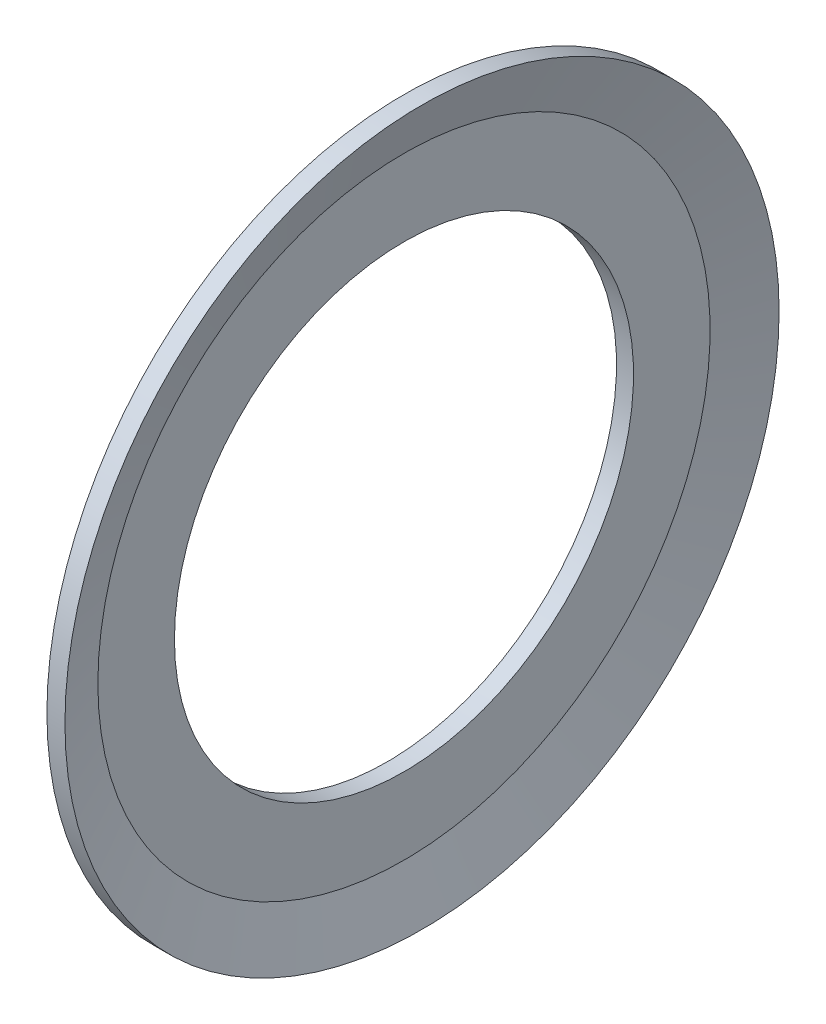
ISO-10303-21;
HEADER;
FILE_DESCRIPTION(('STEP AP214'),'2;1');
FILE_NAME('part.step','',(''),(''),'','','');
FILE_SCHEMA(('AUTOMOTIVE_DESIGN { 1 0 10303 214 1 1 1 1 }'));
ENDSEC;
DATA;
#1=APPLICATION_CONTEXT('core data for automotive mechanical design processes');
#2=APPLICATION_PROTOCOL_DEFINITION('international standard','automotive_design',2000,#1);
#3=PRODUCT_CONTEXT('',#1,'mechanical');
#4=PRODUCT('Part','Part','',(#3));
#5=PRODUCT_RELATED_PRODUCT_CATEGORY('part','',(#4));
#6=PRODUCT_DEFINITION_FORMATION('','',#4);
#7=PRODUCT_DEFINITION_CONTEXT('part definition',#1,'design');
#8=PRODUCT_DEFINITION('design','',#6,#7);
#9=PRODUCT_DEFINITION_SHAPE('','',#8);
#10=(LENGTH_UNIT() NAMED_UNIT(*) SI_UNIT(.MILLI.,.METRE.));
#11=(NAMED_UNIT(*) PLANE_ANGLE_UNIT() SI_UNIT($,.RADIAN.));
#12=(NAMED_UNIT(*) SI_UNIT($,.STERADIAN.) SOLID_ANGLE_UNIT());
#13=UNCERTAINTY_MEASURE_WITH_UNIT(LENGTH_MEASURE(1.E-05),#10,'distance_accuracy_value','');
#14=(GEOMETRIC_REPRESENTATION_CONTEXT(3) GLOBAL_UNCERTAINTY_ASSIGNED_CONTEXT((#13)) GLOBAL_UNIT_ASSIGNED_CONTEXT((#10,
#11,#12)) REPRESENTATION_CONTEXT('',''));
#15=CARTESIAN_POINT('',(0.,0.,0.));
#16=DIRECTION('',(0.,0.,1.));
#17=DIRECTION('',(1.,0.,0.));
#18=AXIS2_PLACEMENT_3D('',#15,#16,#17);
#19=CARTESIAN_POINT('',(0.,0.,0.));
#20=DIRECTION('',(-1.,0.,0.));
#21=DIRECTION('',(0.,0.,1.));
#22=AXIS2_PLACEMENT_3D('',#19,#20,#21);
#23=CYLINDRICAL_SURFACE('',#22,13.5);
#24=CARTESIAN_POINT('',(0.,0.,0.));
#25=DIRECTION('',(-1.,0.,0.));
#26=DIRECTION('',(0.,0.,1.));
#27=AXIS2_PLACEMENT_3D('',#24,#25,#26);
#28=CIRCLE('',#27,13.5);
#29=CARTESIAN_POINT('',(0.,0.,13.5));
#30=VERTEX_POINT('',#29);
#31=EDGE_CURVE('E54',#30,#30,#28,.T.);
#32=ORIENTED_EDGE('',*,*,#31,.T.);
#33=EDGE_LOOP('',(#32));
#34=FACE_BOUND('',#33,.T.);
#35=CARTESIAN_POINT('',(1.,0.,0.));
#36=DIRECTION('',(-1.,0.,0.));
#37=DIRECTION('',(0.,0.,1.));
#38=AXIS2_PLACEMENT_3D('',#35,#36,#37);
#39=CIRCLE('',#38,13.5);
#40=CARTESIAN_POINT('',(1.,0.,13.5));
#41=VERTEX_POINT('',#40);
#42=EDGE_CURVE('E10',#41,#41,#39,.T.);
#43=ORIENTED_EDGE('',*,*,#42,.F.);
#44=EDGE_LOOP('',(#43));
#45=FACE_BOUND('',#44,.T.);
#46=ADVANCED_FACE('F32',(#34,#45),#23,.F.);
#47=CARTESIAN_POINT('',(1.,18.0032584149185,0.));
#48=DIRECTION('',(1.,0.,0.));
#49=DIRECTION('',(0.,0.,-1.));
#50=AXIS2_PLACEMENT_3D('',#47,#48,#49);
#51=PLANE('',#50);
#52=ORIENTED_EDGE('',*,*,#42,.T.);
#53=EDGE_LOOP('',(#52));
#54=FACE_BOUND('',#53,.T.);
#55=CARTESIAN_POINT('',(1.,0.,0.));
#56=DIRECTION('',(-1.,0.,0.));
#57=DIRECTION('',(0.,0.,1.));
#58=AXIS2_PLACEMENT_3D('',#55,#56,#57);
#59=CIRCLE('',#58,18.0032584149185);
#60=CARTESIAN_POINT('',(1.,0.,18.0032584149185));
#61=VERTEX_POINT('',#60);
#62=EDGE_CURVE('E38',#61,#61,#59,.T.);
#63=ORIENTED_EDGE('',*,*,#62,.F.);
#64=EDGE_LOOP('',(#63));
#65=FACE_BOUND('',#64,.T.);
#66=ADVANCED_FACE('F72',(#54,#65),#51,.T.);
#67=CARTESIAN_POINT('',(2.06061327069679,0.,0.));
#68=DIRECTION('',(1.,0.,0.));
#69=DIRECTION('',(0.,0.,-1.));
#70=AXIS2_PLACEMENT_3D('',#67,#68,#69);
#71=CONICAL_SURFACE('',#70,21.,1.2306316555812);
#72=ORIENTED_EDGE('',*,*,#62,.T.);
#73=EDGE_LOOP('',(#72));
#74=FACE_BOUND('',#73,.T.);
#75=CARTESIAN_POINT('',(2.06061327069679,0.,0.));
#76=DIRECTION('',(-1.,0.,0.));
#77=DIRECTION('',(0.,0.,1.));
#78=AXIS2_PLACEMENT_3D('',#75,#76,#77);
#79=CIRCLE('',#78,21.);
#80=CARTESIAN_POINT('',(2.06061327069679,0.,21.));
#81=VERTEX_POINT('',#80);
#82=EDGE_CURVE('E42',#81,#81,#79,.T.);
#83=ORIENTED_EDGE('',*,*,#82,.F.);
#84=EDGE_LOOP('',(#83));
#85=FACE_BOUND('',#84,.T.);
#86=ADVANCED_FACE('F76',(#74,#85),#71,.F.);
#87=CARTESIAN_POINT('',(0.,0.,0.));
#88=DIRECTION('',(-1.,0.,0.));
#89=DIRECTION('',(0.,0.,1.));
#90=AXIS2_PLACEMENT_3D('',#87,#88,#89);
#91=CYLINDRICAL_SURFACE('',#90,21.);
#92=ORIENTED_EDGE('',*,*,#82,.T.);
#93=EDGE_LOOP('',(#92));
#94=FACE_BOUND('',#93,.T.);
#95=CARTESIAN_POINT('',(0.999830117029251,0.,0.));
#96=DIRECTION('',(-1.,0.,0.));
#97=DIRECTION('',(0.,0.,1.));
#98=AXIS2_PLACEMENT_3D('',#95,#96,#97);
#99=CIRCLE('',#98,21.);
#100=CARTESIAN_POINT('',(0.999830117029251,0.,21.));
#101=VERTEX_POINT('',#100);
#102=EDGE_CURVE('E46',#101,#101,#99,.T.);
#103=ORIENTED_EDGE('',*,*,#102,.F.);
#104=EDGE_LOOP('',(#103));
#105=FACE_BOUND('',#104,.T.);
#106=ADVANCED_FACE('F68',(#94,#105),#91,.T.);
#107=CARTESIAN_POINT('',(0.,0.,0.));
#108=DIRECTION('',(1.,0.,0.));
#109=DIRECTION('',(0.,0.,-1.));
#110=AXIS2_PLACEMENT_3D('',#107,#108,#109);
#111=CONICAL_SURFACE('',#110,18.175,1.2306316555812);
#112=ORIENTED_EDGE('',*,*,#102,.T.);
#113=EDGE_LOOP('',(#112));
#114=FACE_BOUND('',#113,.T.);
#115=CARTESIAN_POINT('',(0.,0.,0.));
#116=DIRECTION('',(-1.,0.,0.));
#117=DIRECTION('',(0.,0.,1.));
#118=AXIS2_PLACEMENT_3D('',#115,#116,#117);
#119=CIRCLE('',#118,18.175);
#120=CARTESIAN_POINT('',(0.,0.,18.175));
#121=VERTEX_POINT('',#120);
#122=EDGE_CURVE('E51',#121,#121,#119,.T.);
#123=ORIENTED_EDGE('',*,*,#122,.F.);
#124=EDGE_LOOP('',(#123));
#125=FACE_BOUND('',#124,.T.);
#126=ADVANCED_FACE('F62',(#114,#125),#111,.T.);
#127=CARTESIAN_POINT('',(0.,13.5,0.));
#128=DIRECTION('',(-1.,0.,0.));
#129=DIRECTION('',(0.,0.,1.));
#130=AXIS2_PLACEMENT_3D('',#127,#128,#129);
#131=PLANE('',#130);
#132=ORIENTED_EDGE('',*,*,#122,.T.);
#133=EDGE_LOOP('',(#132));
#134=FACE_BOUND('',#133,.T.);
#135=ORIENTED_EDGE('',*,*,#31,.F.);
#136=EDGE_LOOP('',(#135));
#137=FACE_BOUND('',#136,.T.);
#138=ADVANCED_FACE('F60',(#134,#137),#131,.T.);
#139=CLOSED_SHELL('',(#46,#66,#86,#106,#126,#138));
#140=MANIFOLD_SOLID_BREP('B2',#139);
#141=ADVANCED_BREP_SHAPE_REPRESENTATION('',(#18,#140),#14);
#142=SHAPE_DEFINITION_REPRESENTATION(#9,#141);
ENDSEC;
END-ISO-10303-21;
